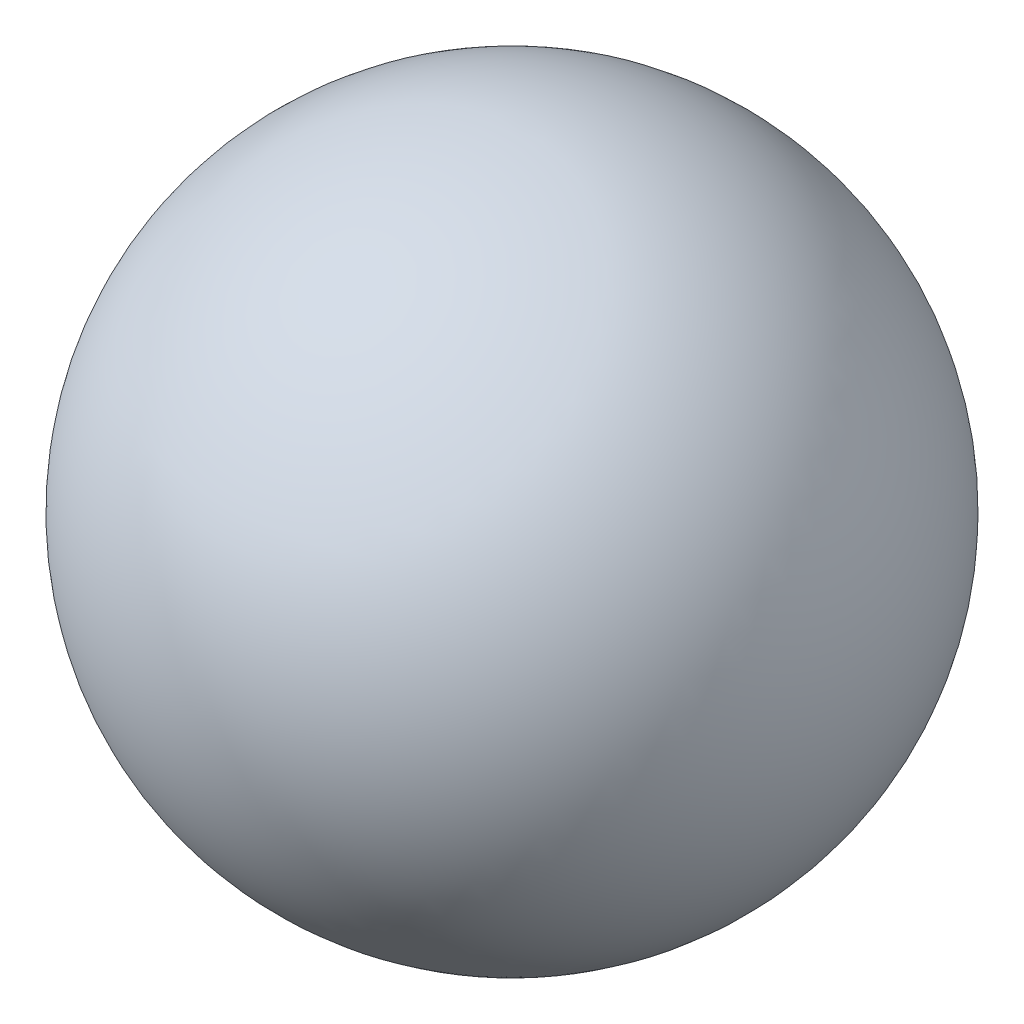
ISO-10303-21;
HEADER;
FILE_DESCRIPTION(('STEP AP214'),'2;1');
FILE_NAME('part.step','',(''),(''),'','','');
FILE_SCHEMA(('AUTOMOTIVE_DESIGN { 1 0 10303 214 1 1 1 1 }'));
ENDSEC;
DATA;
#1=APPLICATION_CONTEXT('core data for automotive mechanical design processes');
#2=APPLICATION_PROTOCOL_DEFINITION('international standard','automotive_design',2000,#1);
#3=PRODUCT_CONTEXT('',#1,'mechanical');
#4=PRODUCT('Part','Part','',(#3));
#5=PRODUCT_RELATED_PRODUCT_CATEGORY('part','',(#4));
#6=PRODUCT_DEFINITION_FORMATION('','',#4);
#7=PRODUCT_DEFINITION_CONTEXT('part definition',#1,'design');
#8=PRODUCT_DEFINITION('design','',#6,#7);
#9=PRODUCT_DEFINITION_SHAPE('','',#8);
#10=(LENGTH_UNIT() NAMED_UNIT(*) SI_UNIT(.MILLI.,.METRE.));
#11=(NAMED_UNIT(*) PLANE_ANGLE_UNIT() SI_UNIT($,.RADIAN.));
#12=(NAMED_UNIT(*) SI_UNIT($,.STERADIAN.) SOLID_ANGLE_UNIT());
#13=UNCERTAINTY_MEASURE_WITH_UNIT(LENGTH_MEASURE(1.E-05),#10,'distance_accuracy_value','');
#14=(GEOMETRIC_REPRESENTATION_CONTEXT(3) GLOBAL_UNCERTAINTY_ASSIGNED_CONTEXT((#13)) GLOBAL_UNIT_ASSIGNED_CONTEXT((#10,
#11,#12)) REPRESENTATION_CONTEXT('',''));
#15=CARTESIAN_POINT('',(0.,0.,0.));
#16=DIRECTION('',(0.,0.,1.));
#17=DIRECTION('',(1.,0.,0.));
#18=AXIS2_PLACEMENT_3D('',#15,#16,#17);
#19=CARTESIAN_POINT('',(0.,0.,0.));
#20=DIRECTION('',(0.,-1.,0.));
#21=DIRECTION('',(-1.,0.,0.));
#22=AXIS2_PLACEMENT_3D('',#19,#20,#21);
#23=SPHERICAL_SURFACE('',#22,5.);
#24=CARTESIAN_POINT('',(0.,-4.46514277487294,0.));
#25=DIRECTION('',(0.,1.,0.));
#26=DIRECTION('',(0.,0.,1.));
#27=AXIS2_PLACEMENT_3D('',#24,#25,#26);
#28=CIRCLE('',#27,2.24999999999999);
#29=CARTESIAN_POINT('',(0.,-4.46514277487294,2.24999999999999));
#30=VERTEX_POINT('',#29);
#31=EDGE_CURVE('E11',#30,#30,#28,.F.);
#32=ORIENTED_EDGE('',*,*,#31,.F.);
#33=EDGE_LOOP('',(#32));
#34=FACE_BOUND('',#33,.T.);
#35=ADVANCED_FACE('F33',(#34),#23,.T.);
#36=CARTESIAN_POINT('',(0.,2.5,0.));
#37=DIRECTION('',(0.,-1.,0.));
#38=DIRECTION('',(0.,0.,-1.));
#39=AXIS2_PLACEMENT_3D('',#36,#37,#38);
#40=CONICAL_SURFACE('',#39,2.25,1.02974425867665);
#41=CARTESIAN_POINT('',(0.,3.85193639281201,0.));
#42=VERTEX_POINT('',#41);
#43=VERTEX_LOOP('',#42);
#44=FACE_BOUND('',#43,.T.);
#45=CARTESIAN_POINT('',(0.,2.5,0.));
#46=DIRECTION('',(0.,-1.,0.));
#47=DIRECTION('',(0.,0.,-1.));
#48=AXIS2_PLACEMENT_3D('',#45,#46,#47);
#49=CIRCLE('',#48,2.25);
#50=CARTESIAN_POINT('',(0.,2.5,-2.25));
#51=VERTEX_POINT('',#50);
#52=EDGE_CURVE('E39',#51,#51,#49,.T.);
#53=ORIENTED_EDGE('',*,*,#52,.T.);
#54=EDGE_LOOP('',(#53));
#55=FACE_BOUND('',#54,.T.);
#56=ADVANCED_FACE('F42',(#44,#55),#40,.F.);
#57=CARTESIAN_POINT('',(0.,-5.,0.));
#58=DIRECTION('',(0.,-1.,0.));
#59=DIRECTION('',(0.,0.,-1.));
#60=AXIS2_PLACEMENT_3D('',#57,#58,#59);
#61=CYLINDRICAL_SURFACE('',#60,2.24999999999999);
#62=ORIENTED_EDGE('',*,*,#31,.T.);
#63=EDGE_LOOP('',(#62));
#64=FACE_BOUND('',#63,.T.);
#65=ORIENTED_EDGE('',*,*,#52,.F.);
#66=EDGE_LOOP('',(#65));
#67=FACE_BOUND('',#66,.T.);
#68=ADVANCED_FACE('F45',(#64,#67),#61,.F.);
#69=CLOSED_SHELL('',(#35,#56,#68));
#70=MANIFOLD_SOLID_BREP('B2',#69);
#71=ADVANCED_BREP_SHAPE_REPRESENTATION('',(#18,#70),#14);
#72=SHAPE_DEFINITION_REPRESENTATION(#9,#71);
ENDSEC;
END-ISO-10303-21;
